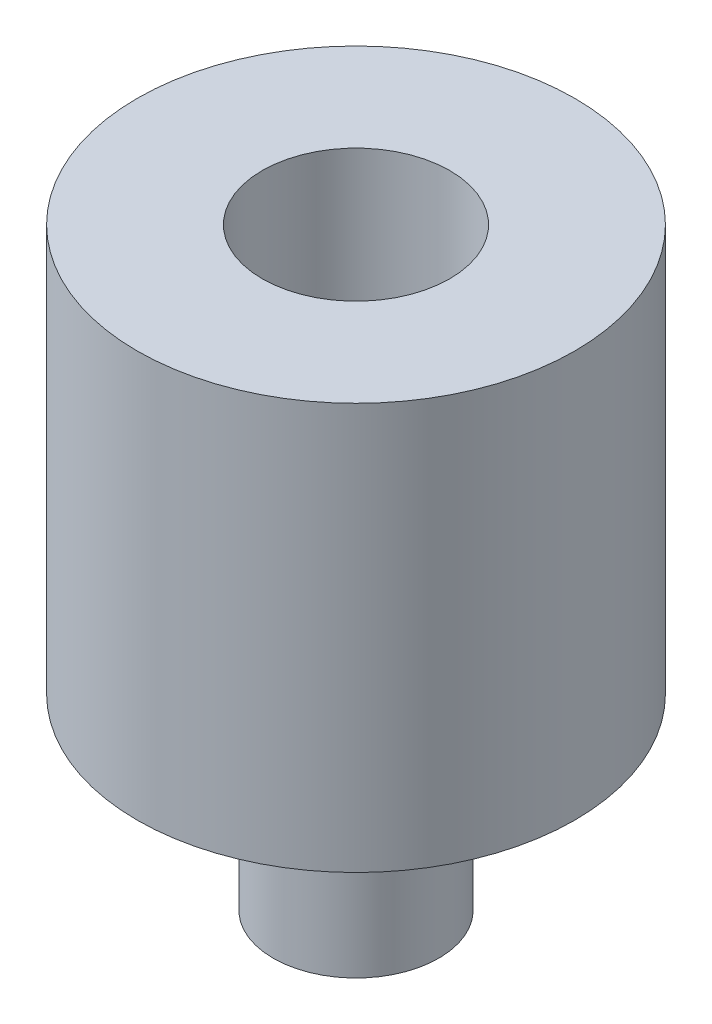
ISO-10303-21;
HEADER;
FILE_DESCRIPTION(('STEP AP214'),'2;1');
FILE_NAME('part.step','',(''),(''),'','','');
FILE_SCHEMA(('AUTOMOTIVE_DESIGN { 1 0 10303 214 1 1 1 1 }'));
ENDSEC;
DATA;
#1=APPLICATION_CONTEXT('core data for automotive mechanical design processes');
#2=APPLICATION_PROTOCOL_DEFINITION('international standard','automotive_design',2000,#1);
#3=PRODUCT_CONTEXT('',#1,'mechanical');
#4=PRODUCT('Part','Part','',(#3));
#5=PRODUCT_RELATED_PRODUCT_CATEGORY('part','',(#4));
#6=PRODUCT_DEFINITION_FORMATION('','',#4);
#7=PRODUCT_DEFINITION_CONTEXT('part definition',#1,'design');
#8=PRODUCT_DEFINITION('design','',#6,#7);
#9=PRODUCT_DEFINITION_SHAPE('','',#8);
#10=(LENGTH_UNIT() NAMED_UNIT(*) SI_UNIT(.MILLI.,.METRE.));
#11=(NAMED_UNIT(*) PLANE_ANGLE_UNIT() SI_UNIT($,.RADIAN.));
#12=(NAMED_UNIT(*) SI_UNIT($,.STERADIAN.) SOLID_ANGLE_UNIT());
#13=UNCERTAINTY_MEASURE_WITH_UNIT(LENGTH_MEASURE(1.E-05),#10,'distance_accuracy_value','');
#14=(GEOMETRIC_REPRESENTATION_CONTEXT(3) GLOBAL_UNCERTAINTY_ASSIGNED_CONTEXT((#13)) GLOBAL_UNIT_ASSIGNED_CONTEXT((#10,
#11,#12)) REPRESENTATION_CONTEXT('',''));
#15=CARTESIAN_POINT('',(0.,0.,0.));
#16=DIRECTION('',(0.,0.,1.));
#17=DIRECTION('',(1.,0.,0.));
#18=AXIS2_PLACEMENT_3D('',#15,#16,#17);
#19=CARTESIAN_POINT('',(0.,3.,0.));
#20=DIRECTION('',(0.,-1.,0.));
#21=DIRECTION('',(0.,0.,-1.));
#22=AXIS2_PLACEMENT_3D('',#19,#20,#21);
#23=CYLINDRICAL_SURFACE('',#22,1.325);
#24=CARTESIAN_POINT('',(0.,3.,0.));
#25=DIRECTION('',(0.,1.,0.));
#26=DIRECTION('',(0.,0.,1.));
#27=AXIS2_PLACEMENT_3D('',#24,#25,#26);
#28=CIRCLE('',#27,1.325);
#29=CARTESIAN_POINT('',(0.,3.,1.325));
#30=VERTEX_POINT('',#29);
#31=EDGE_CURVE('E36',#30,#30,#28,.T.);
#32=ORIENTED_EDGE('',*,*,#31,.F.);
#33=EDGE_LOOP('',(#32));
#34=FACE_BOUND('',#33,.T.);
#35=CARTESIAN_POINT('',(0.,0.,0.));
#36=DIRECTION('',(0.,1.,0.));
#37=DIRECTION('',(0.,0.,1.));
#38=AXIS2_PLACEMENT_3D('',#35,#36,#37);
#39=CIRCLE('',#38,1.325);
#40=CARTESIAN_POINT('',(0.,0.,1.325));
#41=VERTEX_POINT('',#40);
#42=EDGE_CURVE('E40',#41,#41,#39,.T.);
#43=ORIENTED_EDGE('',*,*,#42,.T.);
#44=EDGE_LOOP('',(#43));
#45=FACE_BOUND('',#44,.T.);
#46=ADVANCED_FACE('F30',(#34,#45),#23,.T.);
#47=CARTESIAN_POINT('',(0.,0.,0.));
#48=DIRECTION('',(0.,1.,0.));
#49=DIRECTION('',(0.,0.,1.));
#50=AXIS2_PLACEMENT_3D('',#47,#48,#49);
#51=PLANE('',#50);
#52=ORIENTED_EDGE('',*,*,#42,.F.);
#53=EDGE_LOOP('',(#52));
#54=FACE_BOUND('',#53,.T.);
#55=ADVANCED_FACE('F73',(#54),#51,.F.);
#56=CARTESIAN_POINT('',(0.,4.5,0.));
#57=DIRECTION('',(0.,-1.,0.));
#58=DIRECTION('',(0.,0.,-1.));
#59=AXIS2_PLACEMENT_3D('',#56,#57,#58);
#60=CYLINDRICAL_SURFACE('',#59,3.5);
#61=CARTESIAN_POINT('',(0.,3.,0.));
#62=DIRECTION('',(0.,1.,0.));
#63=DIRECTION('',(0.,0.,1.));
#64=AXIS2_PLACEMENT_3D('',#61,#62,#63);
#65=CIRCLE('',#64,3.5);
#66=CARTESIAN_POINT('',(0.,3.,3.5));
#67=VERTEX_POINT('',#66);
#68=EDGE_CURVE('E45',#67,#67,#65,.T.);
#69=ORIENTED_EDGE('',*,*,#68,.T.);
#70=EDGE_LOOP('',(#69));
#71=FACE_BOUND('',#70,.T.);
#72=CARTESIAN_POINT('',(0.,9.5,0.));
#73=DIRECTION('',(0.,1.,0.));
#74=DIRECTION('',(0.,0.,1.));
#75=AXIS2_PLACEMENT_3D('',#72,#73,#74);
#76=CIRCLE('',#75,3.5);
#77=CARTESIAN_POINT('',(0.,9.5,3.5));
#78=VERTEX_POINT('',#77);
#79=EDGE_CURVE('E49',#78,#78,#76,.T.);
#80=ORIENTED_EDGE('',*,*,#79,.F.);
#81=EDGE_LOOP('',(#80));
#82=FACE_BOUND('',#81,.T.);
#83=ADVANCED_FACE('F69',(#71,#82),#60,.T.);
#84=CARTESIAN_POINT('',(0.,3.,0.));
#85=DIRECTION('',(0.,1.,0.));
#86=DIRECTION('',(0.,0.,1.));
#87=AXIS2_PLACEMENT_3D('',#84,#85,#86);
#88=PLANE('',#87);
#89=ORIENTED_EDGE('',*,*,#31,.T.);
#90=EDGE_LOOP('',(#89));
#91=FACE_BOUND('',#90,.T.);
#92=ORIENTED_EDGE('',*,*,#68,.F.);
#93=EDGE_LOOP('',(#92));
#94=FACE_BOUND('',#93,.T.);
#95=ADVANCED_FACE('F60',(#91,#94),#88,.F.);
#96=CARTESIAN_POINT('',(0.,9.5,0.));
#97=DIRECTION('',(0.,1.,0.));
#98=DIRECTION('',(0.,0.,1.));
#99=AXIS2_PLACEMENT_3D('',#96,#97,#98);
#100=PLANE('',#99);
#101=ORIENTED_EDGE('',*,*,#79,.T.);
#102=EDGE_LOOP('',(#101));
#103=FACE_BOUND('',#102,.T.);
#104=CARTESIAN_POINT('',(0.,9.5,0.));
#105=DIRECTION('',(0.,1.,0.));
#106=DIRECTION('',(0.,0.,1.));
#107=AXIS2_PLACEMENT_3D('',#104,#105,#106);
#108=CIRCLE('',#107,1.5);
#109=CARTESIAN_POINT('',(0.,9.5,1.5));
#110=VERTEX_POINT('',#109);
#111=EDGE_CURVE('E52',#110,#110,#108,.T.);
#112=ORIENTED_EDGE('',*,*,#111,.F.);
#113=EDGE_LOOP('',(#112));
#114=FACE_BOUND('',#113,.T.);
#115=ADVANCED_FACE('F58',(#103,#114),#100,.T.);
#116=CARTESIAN_POINT('',(0.,9.5,0.));
#117=DIRECTION('',(0.,-1.,0.));
#118=DIRECTION('',(0.,0.,-1.));
#119=AXIS2_PLACEMENT_3D('',#116,#117,#118);
#120=CYLINDRICAL_SURFACE('',#119,1.5);
#121=ORIENTED_EDGE('',*,*,#111,.T.);
#122=EDGE_LOOP('',(#121));
#123=FACE_BOUND('',#122,.T.);
#124=CARTESIAN_POINT('',(0.,4.5,0.));
#125=DIRECTION('',(0.,1.,0.));
#126=DIRECTION('',(0.,0.,1.));
#127=AXIS2_PLACEMENT_3D('',#124,#125,#126);
#128=CIRCLE('',#127,1.5);
#129=CARTESIAN_POINT('',(0.,4.5,1.5));
#130=VERTEX_POINT('',#129);
#131=EDGE_CURVE('E10',#130,#130,#128,.F.);
#132=ORIENTED_EDGE('',*,*,#131,.T.);
#133=EDGE_LOOP('',(#132));
#134=FACE_BOUND('',#133,.T.);
#135=ADVANCED_FACE('F56',(#123,#134),#120,.F.);
#136=CARTESIAN_POINT('',(0.,4.5,0.));
#137=DIRECTION('',(0.,1.,0.));
#138=DIRECTION('',(0.,0.,1.));
#139=AXIS2_PLACEMENT_3D('',#136,#137,#138);
#140=PLANE('',#139);
#141=ORIENTED_EDGE('',*,*,#131,.F.);
#142=EDGE_LOOP('',(#141));
#143=FACE_BOUND('',#142,.T.);
#144=ADVANCED_FACE('F67',(#143),#140,.T.);
#145=CLOSED_SHELL('',(#46,#55,#83,#95,#115,#135,#144));
#146=MANIFOLD_SOLID_BREP('B2',#145);
#147=ADVANCED_BREP_SHAPE_REPRESENTATION('',(#18,#146),#14);
#148=SHAPE_DEFINITION_REPRESENTATION(#9,#147);
ENDSEC;
END-ISO-10303-21;
